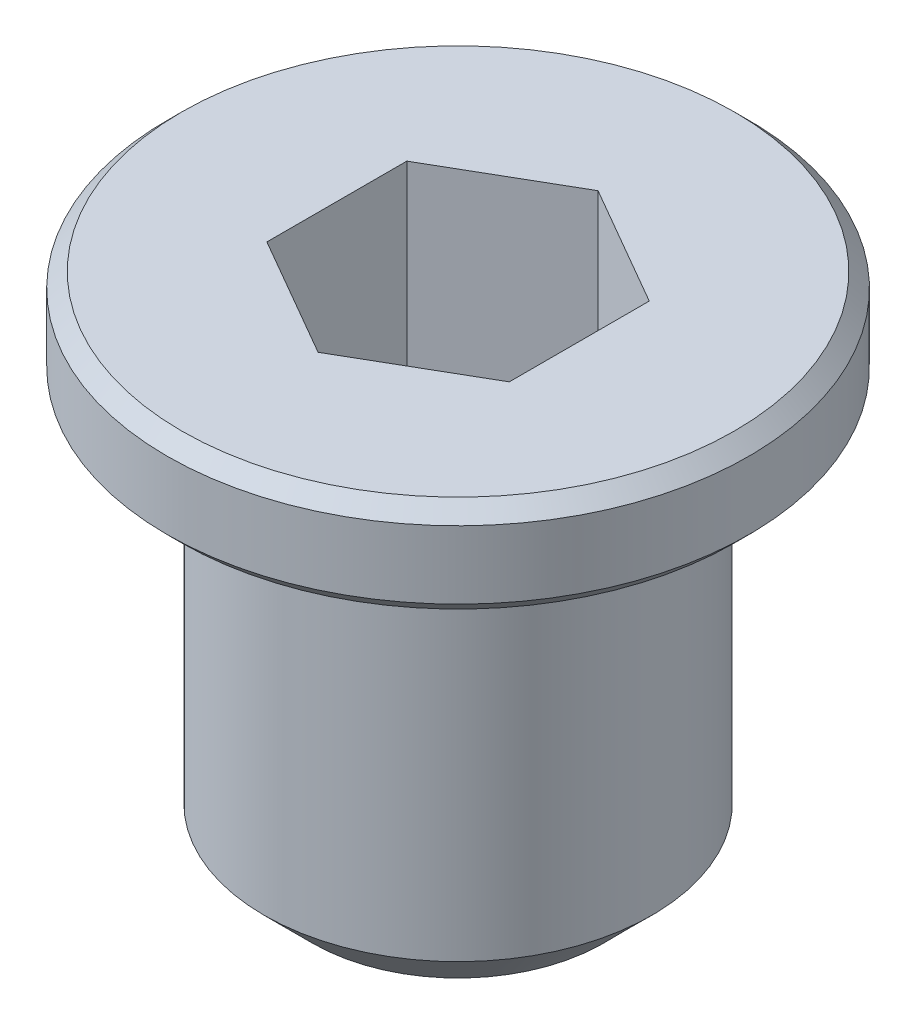
ISO-10303-21;
HEADER;
FILE_DESCRIPTION(('STEP AP214'),'2;1');
FILE_NAME('part.step','',(''),(''),'','','');
FILE_SCHEMA(('AUTOMOTIVE_DESIGN { 1 0 10303 214 1 1 1 1 }'));
ENDSEC;
DATA;
#1=APPLICATION_CONTEXT('core data for automotive mechanical design processes');
#2=APPLICATION_PROTOCOL_DEFINITION('international standard','automotive_design',2000,#1);
#3=PRODUCT_CONTEXT('',#1,'mechanical');
#4=PRODUCT('Part','Part','',(#3));
#5=PRODUCT_RELATED_PRODUCT_CATEGORY('part','',(#4));
#6=PRODUCT_DEFINITION_FORMATION('','',#4);
#7=PRODUCT_DEFINITION_CONTEXT('part definition',#1,'design');
#8=PRODUCT_DEFINITION('design','',#6,#7);
#9=PRODUCT_DEFINITION_SHAPE('','',#8);
#10=(LENGTH_UNIT() NAMED_UNIT(*) SI_UNIT(.MILLI.,.METRE.));
#11=(NAMED_UNIT(*) PLANE_ANGLE_UNIT() SI_UNIT($,.RADIAN.));
#12=(NAMED_UNIT(*) SI_UNIT($,.STERADIAN.) SOLID_ANGLE_UNIT());
#13=UNCERTAINTY_MEASURE_WITH_UNIT(LENGTH_MEASURE(1.E-05),#10,'distance_accuracy_value','');
#14=(GEOMETRIC_REPRESENTATION_CONTEXT(3) GLOBAL_UNCERTAINTY_ASSIGNED_CONTEXT((#13)) GLOBAL_UNIT_ASSIGNED_CONTEXT((#10,
#11,#12)) REPRESENTATION_CONTEXT('',''));
#15=CARTESIAN_POINT('',(0.,0.,0.));
#16=DIRECTION('',(0.,0.,1.));
#17=DIRECTION('',(1.,0.,0.));
#18=AXIS2_PLACEMENT_3D('',#15,#16,#17);
#19=CARTESIAN_POINT('',(0.,-8.5,0.));
#20=DIRECTION('',(0.,1.,0.));
#21=DIRECTION('',(0.,0.,1.));
#22=AXIS2_PLACEMENT_3D('',#19,#20,#21);
#23=CYLINDRICAL_SURFACE('',#22,2.);
#24=CARTESIAN_POINT('',(0.,-8.5,0.));
#25=DIRECTION('',(0.,1.,0.));
#26=DIRECTION('',(0.,0.,1.));
#27=AXIS2_PLACEMENT_3D('',#24,#25,#26);
#28=CIRCLE('',#27,2.);
#29=CARTESIAN_POINT('',(0.,-8.5,2.));
#30=VERTEX_POINT('',#29);
#31=EDGE_CURVE('E136',#30,#30,#28,.T.);
#32=ORIENTED_EDGE('',*,*,#31,.F.);
#33=EDGE_LOOP('',(#32));
#34=FACE_BOUND('',#33,.T.);
#35=CARTESIAN_POINT('',(0.,-3.5,0.));
#36=DIRECTION('',(0.,1.,0.));
#37=DIRECTION('',(0.,0.,1.));
#38=AXIS2_PLACEMENT_3D('',#35,#36,#37);
#39=CIRCLE('',#38,2.);
#40=CARTESIAN_POINT('',(0.,-3.5,2.));
#41=VERTEX_POINT('',#40);
#42=EDGE_CURVE('E129',#41,#41,#39,.F.);
#43=ORIENTED_EDGE('',*,*,#42,.F.);
#44=EDGE_LOOP('',(#43));
#45=FACE_BOUND('',#44,.T.);
#46=ADVANCED_FACE('F27',(#34,#45),#23,.F.);
#47=CARTESIAN_POINT('',(0.,-8.5,0.));
#48=DIRECTION('',(0.,1.,0.));
#49=DIRECTION('',(0.,0.,1.));
#50=AXIS2_PLACEMENT_3D('',#47,#48,#49);
#51=CYLINDRICAL_SURFACE('',#50,4.);
#52=CARTESIAN_POINT('',(0.,-7.5,0.));
#53=DIRECTION('',(0.,1.,0.));
#54=DIRECTION('',(0.,0.,1.));
#55=AXIS2_PLACEMENT_3D('',#52,#53,#54);
#56=CIRCLE('',#55,4.);
#57=CARTESIAN_POINT('',(0.,-7.5,4.));
#58=VERTEX_POINT('',#57);
#59=EDGE_CURVE('E35',#58,#58,#56,.T.);
#60=ORIENTED_EDGE('',*,*,#59,.T.);
#61=EDGE_LOOP('',(#60));
#62=FACE_BOUND('',#61,.T.);
#63=CARTESIAN_POINT('',(0.,0.,0.));
#64=DIRECTION('',(0.,1.,0.));
#65=DIRECTION('',(0.,0.,1.));
#66=AXIS2_PLACEMENT_3D('',#63,#64,#65);
#67=CIRCLE('',#66,4.);
#68=CARTESIAN_POINT('',(0.,0.,4.));
#69=VERTEX_POINT('',#68);
#70=EDGE_CURVE('E139',#69,#69,#67,.T.);
#71=ORIENTED_EDGE('',*,*,#70,.F.);
#72=EDGE_LOOP('',(#71));
#73=FACE_BOUND('',#72,.T.);
#74=ADVANCED_FACE('F29',(#62,#73),#51,.T.);
#75=CARTESIAN_POINT('',(0.,-8.5,0.));
#76=DIRECTION('',(0.,1.,0.));
#77=DIRECTION('',(0.,0.,1.));
#78=AXIS2_PLACEMENT_3D('',#75,#76,#77);
#79=PLANE('',#78);
#80=CARTESIAN_POINT('',(0.,-8.5,0.));
#81=DIRECTION('',(0.,1.,0.));
#82=DIRECTION('',(0.,0.,1.));
#83=AXIS2_PLACEMENT_3D('',#80,#81,#82);
#84=CIRCLE('',#83,3.);
#85=CARTESIAN_POINT('',(0.,-8.5,3.));
#86=VERTEX_POINT('',#85);
#87=EDGE_CURVE('E11',#86,#86,#84,.F.);
#88=ORIENTED_EDGE('',*,*,#87,.T.);
#89=EDGE_LOOP('',(#88));
#90=FACE_BOUND('',#89,.T.);
#91=ORIENTED_EDGE('',*,*,#31,.T.);
#92=EDGE_LOOP('',(#91));
#93=FACE_BOUND('',#92,.T.);
#94=ADVANCED_FACE('F180',(#90,#93),#79,.F.);
#95=CARTESIAN_POINT('',(0.,2.,0.));
#96=DIRECTION('',(0.,-1.,0.));
#97=DIRECTION('',(0.,0.,-1.));
#98=AXIS2_PLACEMENT_3D('',#95,#96,#97);
#99=CYLINDRICAL_SURFACE('',#98,6.);
#100=CARTESIAN_POINT('',(0.,0.299999999999998,0.));
#101=DIRECTION('',(0.,1.,0.));
#102=DIRECTION('',(0.,0.,1.));
#103=AXIS2_PLACEMENT_3D('',#100,#101,#102);
#104=CIRCLE('',#103,6.);
#105=CARTESIAN_POINT('',(0.,0.299999999999998,6.));
#106=VERTEX_POINT('',#105);
#107=EDGE_CURVE('E147',#106,#106,#104,.T.);
#108=ORIENTED_EDGE('',*,*,#107,.T.);
#109=EDGE_LOOP('',(#108));
#110=FACE_BOUND('',#109,.T.);
#111=CARTESIAN_POINT('',(0.,1.7,0.));
#112=DIRECTION('',(0.,1.,0.));
#113=DIRECTION('',(0.,0.,1.));
#114=AXIS2_PLACEMENT_3D('',#111,#112,#113);
#115=CIRCLE('',#114,6.);
#116=CARTESIAN_POINT('',(0.,1.7,6.));
#117=VERTEX_POINT('',#116);
#118=EDGE_CURVE('E142',#117,#117,#115,.F.);
#119=ORIENTED_EDGE('',*,*,#118,.T.);
#120=EDGE_LOOP('',(#119));
#121=FACE_BOUND('',#120,.T.);
#122=ADVANCED_FACE('F194',(#110,#121),#99,.T.);
#123=CARTESIAN_POINT('',(0.,2.,0.));
#124=DIRECTION('',(0.,1.,0.));
#125=DIRECTION('',(0.,0.,1.));
#126=AXIS2_PLACEMENT_3D('',#123,#124,#125);
#127=PLANE('',#126);
#128=CARTESIAN_POINT('',(0.,2.,0.));
#129=DIRECTION('',(0.,1.,0.));
#130=DIRECTION('',(0.,0.,1.));
#131=AXIS2_PLACEMENT_3D('',#128,#129,#130);
#132=CIRCLE('',#131,5.7);
#133=CARTESIAN_POINT('',(0.,2.,5.7));
#134=VERTEX_POINT('',#133);
#135=EDGE_CURVE('E153',#134,#134,#132,.T.);
#136=ORIENTED_EDGE('',*,*,#135,.T.);
#137=EDGE_LOOP('',(#136));
#138=FACE_BOUND('',#137,.T.);
#139=DIRECTION('',(-0.866025403784439,0.,-0.5));
#140=VECTOR('',#139,1.);
#141=CARTESIAN_POINT('',(2.5,2.,-1.44337567297407));
#142=LINE('',#141,#140);
#143=CARTESIAN_POINT('',(2.5,2.,-1.44337567297407));
#144=VERTEX_POINT('',#143);
#145=CARTESIAN_POINT('',(0.,2.,-2.88675134594813));
#146=VERTEX_POINT('',#145);
#147=EDGE_CURVE('E42',#144,#146,#142,.T.);
#148=ORIENTED_EDGE('',*,*,#147,.F.);
#149=DIRECTION('',(0.,0.,-1.));
#150=VECTOR('',#149,1.);
#151=CARTESIAN_POINT('',(2.5,2.,1.44337567297407));
#152=LINE('',#151,#150);
#153=CARTESIAN_POINT('',(2.5,2.,1.44337567297407));
#154=VERTEX_POINT('',#153);
#155=EDGE_CURVE('E111',#154,#144,#152,.T.);
#156=ORIENTED_EDGE('',*,*,#155,.F.);
#157=DIRECTION('',(0.866025403784439,0.,-0.5));
#158=VECTOR('',#157,1.);
#159=CARTESIAN_POINT('',(0.,2.,2.88675134594813));
#160=LINE('',#159,#158);
#161=CARTESIAN_POINT('',(0.,2.,2.88675134594813));
#162=VERTEX_POINT('',#161);
#163=EDGE_CURVE('E105',#162,#154,#160,.T.);
#164=ORIENTED_EDGE('',*,*,#163,.F.);
#165=DIRECTION('',(0.866025403784439,0.,0.5));
#166=VECTOR('',#165,1.);
#167=CARTESIAN_POINT('',(-2.5,2.,1.44337567297407));
#168=LINE('',#167,#166);
#169=CARTESIAN_POINT('',(-2.5,2.,1.44337567297407));
#170=VERTEX_POINT('',#169);
#171=EDGE_CURVE('E103',#170,#162,#168,.T.);
#172=ORIENTED_EDGE('',*,*,#171,.F.);
#173=DIRECTION('',(0.,0.,1.));
#174=VECTOR('',#173,1.);
#175=CARTESIAN_POINT('',(-2.5,2.,-1.44337567297407));
#176=LINE('',#175,#174);
#177=CARTESIAN_POINT('',(-2.5,2.,-1.44337567297407));
#178=VERTEX_POINT('',#177);
#179=EDGE_CURVE('E85',#178,#170,#176,.T.);
#180=ORIENTED_EDGE('',*,*,#179,.F.);
#181=DIRECTION('',(-0.866025403784439,0.,0.5));
#182=VECTOR('',#181,1.);
#183=CARTESIAN_POINT('',(0.,2.,-2.88675134594813));
#184=LINE('',#183,#182);
#185=EDGE_CURVE('E96',#146,#178,#184,.T.);
#186=ORIENTED_EDGE('',*,*,#185,.F.);
#187=EDGE_LOOP('',(#148,#156,#164,#172,#180,#186));
#188=FACE_BOUND('',#187,.T.);
#189=ADVANCED_FACE('F100',(#138,#188),#127,.T.);
#190=CARTESIAN_POINT('',(0.,0.,0.));
#191=DIRECTION('',(0.,1.,0.));
#192=DIRECTION('',(0.,0.,1.));
#193=AXIS2_PLACEMENT_3D('',#190,#191,#192);
#194=PLANE('',#193);
#195=CARTESIAN_POINT('',(0.,0.,0.));
#196=DIRECTION('',(0.,1.,0.));
#197=DIRECTION('',(0.,0.,1.));
#198=AXIS2_PLACEMENT_3D('',#195,#196,#197);
#199=CIRCLE('',#198,5.7);
#200=CARTESIAN_POINT('',(0.,0.,5.7));
#201=VERTEX_POINT('',#200);
#202=EDGE_CURVE('E150',#201,#201,#199,.F.);
#203=ORIENTED_EDGE('',*,*,#202,.T.);
#204=EDGE_LOOP('',(#203));
#205=FACE_BOUND('',#204,.T.);
#206=ORIENTED_EDGE('',*,*,#70,.T.);
#207=EDGE_LOOP('',(#206));
#208=FACE_BOUND('',#207,.T.);
#209=ADVANCED_FACE('F187',(#205,#208),#194,.F.);
#210=CARTESIAN_POINT('',(0.,-3.5,-2.88675134594813));
#211=DIRECTION('',(0.,1.,0.));
#212=DIRECTION('',(0.,0.,1.));
#213=AXIS2_PLACEMENT_3D('',#210,#211,#212);
#214=PLANE('',#213);
#215=DIRECTION('',(-0.866025403784439,0.,-0.5));
#216=VECTOR('',#215,1.);
#217=CARTESIAN_POINT('',(2.5,-3.5,-1.44337567297407));
#218=LINE('',#217,#216);
#219=CARTESIAN_POINT('',(2.5,-3.5,-1.44337567297407));
#220=VERTEX_POINT('',#219);
#221=CARTESIAN_POINT('',(0.,-3.5,-2.88675134594813));
#222=VERTEX_POINT('',#221);
#223=EDGE_CURVE('E113',#220,#222,#218,.T.);
#224=ORIENTED_EDGE('',*,*,#223,.T.);
#225=DIRECTION('',(-0.866025403784439,0.,0.5));
#226=VECTOR('',#225,1.);
#227=CARTESIAN_POINT('',(0.,-3.5,-2.88675134594813));
#228=LINE('',#227,#226);
#229=CARTESIAN_POINT('',(-2.5,-3.5,-1.44337567297407));
#230=VERTEX_POINT('',#229);
#231=EDGE_CURVE('E116',#222,#230,#228,.T.);
#232=ORIENTED_EDGE('',*,*,#231,.T.);
#233=DIRECTION('',(0.,0.,1.));
#234=VECTOR('',#233,1.);
#235=CARTESIAN_POINT('',(-2.5,-3.5,-1.44337567297407));
#236=LINE('',#235,#234);
#237=CARTESIAN_POINT('',(-2.5,-3.5,1.44337567297407));
#238=VERTEX_POINT('',#237);
#239=EDGE_CURVE('E88',#230,#238,#236,.T.);
#240=ORIENTED_EDGE('',*,*,#239,.T.);
#241=DIRECTION('',(0.866025403784439,0.,0.5));
#242=VECTOR('',#241,1.);
#243=CARTESIAN_POINT('',(-2.5,-3.5,1.44337567297407));
#244=LINE('',#243,#242);
#245=CARTESIAN_POINT('',(0.,-3.5,2.88675134594813));
#246=VERTEX_POINT('',#245);
#247=EDGE_CURVE('E119',#238,#246,#244,.T.);
#248=ORIENTED_EDGE('',*,*,#247,.T.);
#249=DIRECTION('',(0.866025403784439,0.,-0.5));
#250=VECTOR('',#249,1.);
#251=CARTESIAN_POINT('',(0.,-3.5,2.88675134594813));
#252=LINE('',#251,#250);
#253=CARTESIAN_POINT('',(2.5,-3.5,1.44337567297407));
#254=VERTEX_POINT('',#253);
#255=EDGE_CURVE('E122',#246,#254,#252,.T.);
#256=ORIENTED_EDGE('',*,*,#255,.T.);
#257=DIRECTION('',(0.,0.,-1.));
#258=VECTOR('',#257,1.);
#259=CARTESIAN_POINT('',(2.5,-3.5,1.44337567297407));
#260=LINE('',#259,#258);
#261=EDGE_CURVE('E125',#254,#220,#260,.T.);
#262=ORIENTED_EDGE('',*,*,#261,.T.);
#263=EDGE_LOOP('',(#224,#232,#240,#248,#256,#262));
#264=FACE_BOUND('',#263,.T.);
#265=ORIENTED_EDGE('',*,*,#42,.T.);
#266=EDGE_LOOP('',(#265));
#267=FACE_BOUND('',#266,.T.);
#268=ADVANCED_FACE('F190',(#264,#267),#214,.T.);
#269=CARTESIAN_POINT('',(2.5,-3.5,-1.44337567297407));
#270=DIRECTION('',(0.5,0.,-0.866025403784439));
#271=DIRECTION('',(-0.866025403784439,0.,-0.5));
#272=AXIS2_PLACEMENT_3D('',#269,#270,#271);
#273=PLANE('',#272);
#274=ORIENTED_EDGE('',*,*,#147,.T.);
#275=DIRECTION('',(0.,1.,0.));
#276=VECTOR('',#275,1.);
#277=CARTESIAN_POINT('',(0.,-3.5,-2.88675134594813));
#278=LINE('',#277,#276);
#279=EDGE_CURVE('E93',#222,#146,#278,.T.);
#280=ORIENTED_EDGE('',*,*,#279,.F.);
#281=ORIENTED_EDGE('',*,*,#223,.F.);
#282=DIRECTION('',(0.,1.,0.));
#283=VECTOR('',#282,1.);
#284=CARTESIAN_POINT('',(2.5,-3.5,-1.44337567297407));
#285=LINE('',#284,#283);
#286=EDGE_CURVE('E49',#220,#144,#285,.T.);
#287=ORIENTED_EDGE('',*,*,#286,.T.);
#288=EDGE_LOOP('',(#274,#280,#281,#287));
#289=FACE_BOUND('',#288,.T.);
#290=ADVANCED_FACE('F185',(#289),#273,.F.);
#291=CARTESIAN_POINT('',(2.5,-3.5,1.44337567297407));
#292=DIRECTION('',(1.,0.,0.));
#293=DIRECTION('',(0.,0.,-1.));
#294=AXIS2_PLACEMENT_3D('',#291,#292,#293);
#295=PLANE('',#294);
#296=ORIENTED_EDGE('',*,*,#155,.T.);
#297=ORIENTED_EDGE('',*,*,#286,.F.);
#298=ORIENTED_EDGE('',*,*,#261,.F.);
#299=DIRECTION('',(0.,1.,0.));
#300=VECTOR('',#299,1.);
#301=CARTESIAN_POINT('',(2.5,-3.5,1.44337567297407));
#302=LINE('',#301,#300);
#303=EDGE_CURVE('E130',#254,#154,#302,.T.);
#304=ORIENTED_EDGE('',*,*,#303,.T.);
#305=EDGE_LOOP('',(#296,#297,#298,#304));
#306=FACE_BOUND('',#305,.T.);
#307=ADVANCED_FACE('F255',(#306),#295,.F.);
#308=CARTESIAN_POINT('',(0.,-3.5,2.88675134594813));
#309=DIRECTION('',(0.5,0.,0.866025403784439));
#310=DIRECTION('',(0.866025403784439,0.,-0.5));
#311=AXIS2_PLACEMENT_3D('',#308,#309,#310);
#312=PLANE('',#311);
#313=ORIENTED_EDGE('',*,*,#163,.T.);
#314=ORIENTED_EDGE('',*,*,#303,.F.);
#315=ORIENTED_EDGE('',*,*,#255,.F.);
#316=DIRECTION('',(0.,1.,0.));
#317=VECTOR('',#316,1.);
#318=CARTESIAN_POINT('',(0.,-3.5,2.88675134594813));
#319=LINE('',#318,#317);
#320=EDGE_CURVE('E132',#246,#162,#319,.T.);
#321=ORIENTED_EDGE('',*,*,#320,.T.);
#322=EDGE_LOOP('',(#313,#314,#315,#321));
#323=FACE_BOUND('',#322,.T.);
#324=ADVANCED_FACE('F247',(#323),#312,.F.);
#325=CARTESIAN_POINT('',(-2.5,-3.5,1.44337567297407));
#326=DIRECTION('',(-0.5,0.,0.866025403784439));
#327=DIRECTION('',(0.866025403784439,0.,0.5));
#328=AXIS2_PLACEMENT_3D('',#325,#326,#327);
#329=PLANE('',#328);
#330=ORIENTED_EDGE('',*,*,#171,.T.);
#331=ORIENTED_EDGE('',*,*,#320,.F.);
#332=ORIENTED_EDGE('',*,*,#247,.F.);
#333=DIRECTION('',(0.,1.,0.));
#334=VECTOR('',#333,1.);
#335=CARTESIAN_POINT('',(-2.5,-3.5,1.44337567297407));
#336=LINE('',#335,#334);
#337=EDGE_CURVE('E92',#238,#170,#336,.T.);
#338=ORIENTED_EDGE('',*,*,#337,.T.);
#339=EDGE_LOOP('',(#330,#331,#332,#338));
#340=FACE_BOUND('',#339,.T.);
#341=ADVANCED_FACE('F240',(#340),#329,.F.);
#342=CARTESIAN_POINT('',(-2.5,-3.5,-1.44337567297407));
#343=DIRECTION('',(-1.,0.,0.));
#344=DIRECTION('',(0.,0.,1.));
#345=AXIS2_PLACEMENT_3D('',#342,#343,#344);
#346=PLANE('',#345);
#347=ORIENTED_EDGE('',*,*,#179,.T.);
#348=ORIENTED_EDGE('',*,*,#337,.F.);
#349=ORIENTED_EDGE('',*,*,#239,.F.);
#350=DIRECTION('',(0.,1.,0.));
#351=VECTOR('',#350,1.);
#352=CARTESIAN_POINT('',(-2.5,-3.5,-1.44337567297407));
#353=LINE('',#352,#351);
#354=EDGE_CURVE('E81',#230,#178,#353,.T.);
#355=ORIENTED_EDGE('',*,*,#354,.T.);
#356=EDGE_LOOP('',(#347,#348,#349,#355));
#357=FACE_BOUND('',#356,.T.);
#358=ADVANCED_FACE('F83',(#357),#346,.F.);
#359=CARTESIAN_POINT('',(0.,-3.5,-2.88675134594813));
#360=DIRECTION('',(-0.5,0.,-0.866025403784439));
#361=DIRECTION('',(-0.866025403784439,0.,0.5));
#362=AXIS2_PLACEMENT_3D('',#359,#360,#361);
#363=PLANE('',#362);
#364=ORIENTED_EDGE('',*,*,#185,.T.);
#365=ORIENTED_EDGE('',*,*,#354,.F.);
#366=ORIENTED_EDGE('',*,*,#231,.F.);
#367=ORIENTED_EDGE('',*,*,#279,.T.);
#368=EDGE_LOOP('',(#364,#365,#366,#367));
#369=FACE_BOUND('',#368,.T.);
#370=ADVANCED_FACE('F97',(#369),#363,.F.);
#371=CARTESIAN_POINT('',(0.,0.299999999999998,0.));
#372=DIRECTION('',(0.,1.,0.));
#373=DIRECTION('',(0.,0.,1.));
#374=AXIS2_PLACEMENT_3D('',#371,#372,#373);
#375=CONICAL_SURFACE('',#374,6.,0.78539816339745);
#376=ORIENTED_EDGE('',*,*,#202,.F.);
#377=EDGE_LOOP('',(#376));
#378=FACE_BOUND('',#377,.T.);
#379=ORIENTED_EDGE('',*,*,#107,.F.);
#380=EDGE_LOOP('',(#379));
#381=FACE_BOUND('',#380,.T.);
#382=ADVANCED_FACE('F169',(#378,#381),#375,.T.);
#383=CARTESIAN_POINT('',(0.,2.,0.));
#384=DIRECTION('',(0.,-1.,0.));
#385=DIRECTION('',(0.,0.,-1.));
#386=AXIS2_PLACEMENT_3D('',#383,#384,#385);
#387=CONICAL_SURFACE('',#386,5.7,0.785398163397448);
#388=ORIENTED_EDGE('',*,*,#118,.F.);
#389=EDGE_LOOP('',(#388));
#390=FACE_BOUND('',#389,.T.);
#391=ORIENTED_EDGE('',*,*,#135,.F.);
#392=EDGE_LOOP('',(#391));
#393=FACE_BOUND('',#392,.T.);
#394=ADVANCED_FACE('F162',(#390,#393),#387,.T.);
#395=CARTESIAN_POINT('',(0.,-7.5,0.));
#396=DIRECTION('',(0.,1.,0.));
#397=DIRECTION('',(0.,0.,1.));
#398=AXIS2_PLACEMENT_3D('',#395,#396,#397);
#399=CONICAL_SURFACE('',#398,4.,0.78539816339745);
#400=ORIENTED_EDGE('',*,*,#87,.F.);
#401=EDGE_LOOP('',(#400));
#402=FACE_BOUND('',#401,.T.);
#403=ORIENTED_EDGE('',*,*,#59,.F.);
#404=EDGE_LOOP('',(#403));
#405=FACE_BOUND('',#404,.T.);
#406=ADVANCED_FACE('F160',(#402,#405),#399,.T.);
#407=CLOSED_SHELL('',(#46,#74,#94,#122,#189,#209,#268,#290,#307,#324,#341,#358,#370,#382,#394,#406));
#408=MANIFOLD_SOLID_BREP('B2',#407);
#409=ADVANCED_BREP_SHAPE_REPRESENTATION('',(#18,#408),#14);
#410=SHAPE_DEFINITION_REPRESENTATION(#9,#409);
ENDSEC;
END-ISO-10303-21;
